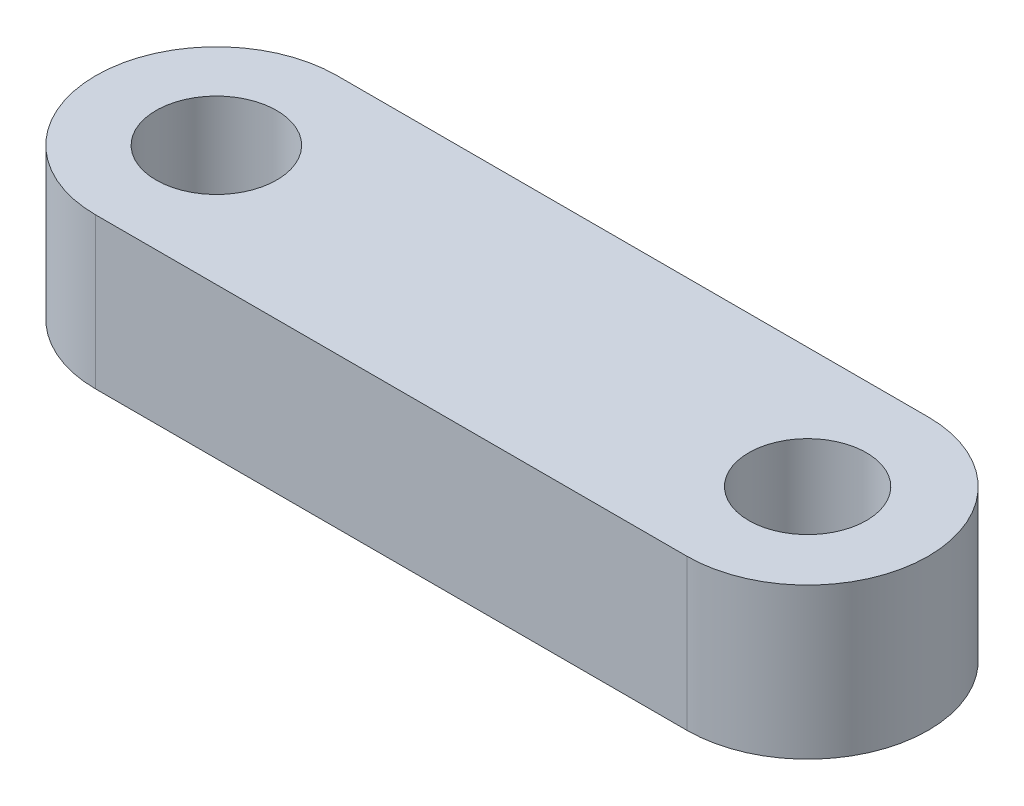
ISO-10303-21;
HEADER;
FILE_DESCRIPTION(('STEP AP214'),'2;1');
FILE_NAME('part.step','',(''),(''),'','','');
FILE_SCHEMA(('AUTOMOTIVE_DESIGN { 1 0 10303 214 1 1 1 1 }'));
ENDSEC;
DATA;
#1=APPLICATION_CONTEXT('core data for automotive mechanical design processes');
#2=APPLICATION_PROTOCOL_DEFINITION('international standard','automotive_design',2000,#1);
#3=PRODUCT_CONTEXT('',#1,'mechanical');
#4=PRODUCT('Part','Part','',(#3));
#5=PRODUCT_RELATED_PRODUCT_CATEGORY('part','',(#4));
#6=PRODUCT_DEFINITION_FORMATION('','',#4);
#7=PRODUCT_DEFINITION_CONTEXT('part definition',#1,'design');
#8=PRODUCT_DEFINITION('design','',#6,#7);
#9=PRODUCT_DEFINITION_SHAPE('','',#8);
#10=(LENGTH_UNIT() NAMED_UNIT(*) SI_UNIT(.MILLI.,.METRE.));
#11=(NAMED_UNIT(*) PLANE_ANGLE_UNIT() SI_UNIT($,.RADIAN.));
#12=(NAMED_UNIT(*) SI_UNIT($,.STERADIAN.) SOLID_ANGLE_UNIT());
#13=UNCERTAINTY_MEASURE_WITH_UNIT(LENGTH_MEASURE(1.E-05),#10,'distance_accuracy_value','');
#14=(GEOMETRIC_REPRESENTATION_CONTEXT(3) GLOBAL_UNCERTAINTY_ASSIGNED_CONTEXT((#13)) GLOBAL_UNIT_ASSIGNED_CONTEXT((#10,
#11,#12)) REPRESENTATION_CONTEXT('',''));
#15=CARTESIAN_POINT('',(0.,0.,0.));
#16=DIRECTION('',(0.,0.,1.));
#17=DIRECTION('',(1.,0.,0.));
#18=AXIS2_PLACEMENT_3D('',#15,#16,#17);
#19=CARTESIAN_POINT('',(0.,5.,0.));
#20=DIRECTION('',(0.,1.,0.));
#21=DIRECTION('',(0.,0.,1.));
#22=AXIS2_PLACEMENT_3D('',#19,#20,#21);
#23=PLANE('',#22);
#24=CARTESIAN_POINT('',(0.,5.,0.));
#25=DIRECTION('',(0.,1.,0.));
#26=DIRECTION('',(0.,0.,1.));
#27=AXIS2_PLACEMENT_3D('',#24,#25,#26);
#28=CIRCLE('',#27,2.);
#29=CARTESIAN_POINT('',(0.,5.,2.));
#30=VERTEX_POINT('',#29);
#31=EDGE_CURVE('E101',#30,#30,#28,.T.);
#32=ORIENTED_EDGE('',*,*,#31,.F.);
#33=EDGE_LOOP('',(#32));
#34=FACE_BOUND('',#33,.T.);
#35=CARTESIAN_POINT('',(0.,5.,0.));
#36=DIRECTION('',(0.,1.,0.));
#37=DIRECTION('',(0.,0.,1.));
#38=AXIS2_PLACEMENT_3D('',#35,#36,#37);
#39=CIRCLE('',#38,4.);
#40=CARTESIAN_POINT('',(0.,5.,-4.));
#41=VERTEX_POINT('',#40);
#42=CARTESIAN_POINT('',(0.,5.,4.));
#43=VERTEX_POINT('',#42);
#44=EDGE_CURVE('E86',#41,#43,#39,.T.);
#45=ORIENTED_EDGE('',*,*,#44,.T.);
#46=DIRECTION('',(1.,0.,0.));
#47=VECTOR('',#46,1.);
#48=CARTESIAN_POINT('',(0.,5.,4.));
#49=LINE('',#48,#47);
#50=CARTESIAN_POINT('',(19.604,5.,4.));
#51=VERTEX_POINT('',#50);
#52=EDGE_CURVE('E81',#43,#51,#49,.T.);
#53=ORIENTED_EDGE('',*,*,#52,.T.);
#54=CARTESIAN_POINT('',(19.604,5.,0.));
#55=DIRECTION('',(0.,1.,0.));
#56=DIRECTION('',(0.,0.,1.));
#57=AXIS2_PLACEMENT_3D('',#54,#55,#56);
#58=CIRCLE('',#57,4.);
#59=CARTESIAN_POINT('',(19.604,5.,-4.));
#60=VERTEX_POINT('',#59);
#61=EDGE_CURVE('E84',#51,#60,#58,.T.);
#62=ORIENTED_EDGE('',*,*,#61,.T.);
#63=DIRECTION('',(-1.,0.,0.));
#64=VECTOR('',#63,1.);
#65=CARTESIAN_POINT('',(0.,5.,-4.));
#66=LINE('',#65,#64);
#67=EDGE_CURVE('E51',#60,#41,#66,.T.);
#68=ORIENTED_EDGE('',*,*,#67,.T.);
#69=EDGE_LOOP('',(#45,#53,#62,#68));
#70=FACE_BOUND('',#69,.T.);
#71=CARTESIAN_POINT('',(19.604,5.,0.));
#72=DIRECTION('',(0.,1.,0.));
#73=DIRECTION('',(0.,0.,1.));
#74=AXIS2_PLACEMENT_3D('',#71,#72,#73);
#75=CIRCLE('',#74,1.95);
#76=CARTESIAN_POINT('',(19.604,5.,1.95));
#77=VERTEX_POINT('',#76);
#78=EDGE_CURVE('E116',#77,#77,#75,.T.);
#79=ORIENTED_EDGE('',*,*,#78,.F.);
#80=EDGE_LOOP('',(#79));
#81=FACE_BOUND('',#80,.T.);
#82=ADVANCED_FACE('F34',(#34,#70,#81),#23,.T.);
#83=CARTESIAN_POINT('',(0.,0.,0.));
#84=DIRECTION('',(0.,1.,0.));
#85=DIRECTION('',(0.,0.,1.));
#86=AXIS2_PLACEMENT_3D('',#83,#84,#85);
#87=PLANE('',#86);
#88=CARTESIAN_POINT('',(0.,0.,0.));
#89=DIRECTION('',(0.,1.,0.));
#90=DIRECTION('',(0.,0.,1.));
#91=AXIS2_PLACEMENT_3D('',#88,#89,#90);
#92=CIRCLE('',#91,4.);
#93=CARTESIAN_POINT('',(0.,0.,-4.));
#94=VERTEX_POINT('',#93);
#95=CARTESIAN_POINT('',(0.,0.,4.));
#96=VERTEX_POINT('',#95);
#97=EDGE_CURVE('E98',#94,#96,#92,.T.);
#98=ORIENTED_EDGE('',*,*,#97,.F.);
#99=DIRECTION('',(-1.,0.,0.));
#100=VECTOR('',#99,1.);
#101=CARTESIAN_POINT('',(0.,0.,-4.));
#102=LINE('',#101,#100);
#103=CARTESIAN_POINT('',(19.604,0.,-4.));
#104=VERTEX_POINT('',#103);
#105=EDGE_CURVE('E74',#104,#94,#102,.T.);
#106=ORIENTED_EDGE('',*,*,#105,.F.);
#107=CARTESIAN_POINT('',(19.604,0.,0.));
#108=DIRECTION('',(0.,1.,0.));
#109=DIRECTION('',(0.,0.,1.));
#110=AXIS2_PLACEMENT_3D('',#107,#108,#109);
#111=CIRCLE('',#110,4.);
#112=CARTESIAN_POINT('',(19.604,0.,4.));
#113=VERTEX_POINT('',#112);
#114=EDGE_CURVE('E68',#113,#104,#111,.T.);
#115=ORIENTED_EDGE('',*,*,#114,.F.);
#116=DIRECTION('',(1.,0.,0.));
#117=VECTOR('',#116,1.);
#118=CARTESIAN_POINT('',(0.,0.,4.));
#119=LINE('',#118,#117);
#120=EDGE_CURVE('E90',#96,#113,#119,.T.);
#121=ORIENTED_EDGE('',*,*,#120,.F.);
#122=EDGE_LOOP('',(#98,#106,#115,#121));
#123=FACE_BOUND('',#122,.T.);
#124=CARTESIAN_POINT('',(0.,0.,0.));
#125=DIRECTION('',(0.,1.,0.));
#126=DIRECTION('',(0.,0.,1.));
#127=AXIS2_PLACEMENT_3D('',#124,#125,#126);
#128=CIRCLE('',#127,2.);
#129=CARTESIAN_POINT('',(0.,0.,2.));
#130=VERTEX_POINT('',#129);
#131=EDGE_CURVE('E113',#130,#130,#128,.T.);
#132=ORIENTED_EDGE('',*,*,#131,.T.);
#133=EDGE_LOOP('',(#132));
#134=FACE_BOUND('',#133,.T.);
#135=CARTESIAN_POINT('',(19.604,0.,0.));
#136=DIRECTION('',(0.,1.,0.));
#137=DIRECTION('',(0.,0.,1.));
#138=AXIS2_PLACEMENT_3D('',#135,#136,#137);
#139=CIRCLE('',#138,1.95);
#140=CARTESIAN_POINT('',(19.604,0.,1.95));
#141=VERTEX_POINT('',#140);
#142=EDGE_CURVE('E119',#141,#141,#139,.T.);
#143=ORIENTED_EDGE('',*,*,#142,.T.);
#144=EDGE_LOOP('',(#143));
#145=FACE_BOUND('',#144,.T.);
#146=ADVANCED_FACE('F109',(#123,#134,#145),#87,.F.);
#147=CARTESIAN_POINT('',(0.,5.,0.));
#148=DIRECTION('',(0.,-1.,0.));
#149=DIRECTION('',(0.,0.,-1.));
#150=AXIS2_PLACEMENT_3D('',#147,#148,#149);
#151=CYLINDRICAL_SURFACE('',#150,4.);
#152=ORIENTED_EDGE('',*,*,#97,.T.);
#153=DIRECTION('',(0.,-1.,0.));
#154=VECTOR('',#153,1.);
#155=CARTESIAN_POINT('',(0.,5.,4.));
#156=LINE('',#155,#154);
#157=EDGE_CURVE('E11',#43,#96,#156,.T.);
#158=ORIENTED_EDGE('',*,*,#157,.F.);
#159=ORIENTED_EDGE('',*,*,#44,.F.);
#160=DIRECTION('',(0.,-1.,0.));
#161=VECTOR('',#160,1.);
#162=CARTESIAN_POINT('',(0.,5.,-4.));
#163=LINE('',#162,#161);
#164=EDGE_CURVE('E94',#41,#94,#163,.T.);
#165=ORIENTED_EDGE('',*,*,#164,.T.);
#166=EDGE_LOOP('',(#152,#158,#159,#165));
#167=FACE_BOUND('',#166,.T.);
#168=ADVANCED_FACE('F36',(#167),#151,.T.);
#169=CARTESIAN_POINT('',(0.,5.,4.));
#170=DIRECTION('',(0.,0.,-1.));
#171=DIRECTION('',(-1.,0.,0.));
#172=AXIS2_PLACEMENT_3D('',#169,#170,#171);
#173=PLANE('',#172);
#174=ORIENTED_EDGE('',*,*,#120,.T.);
#175=DIRECTION('',(0.,-1.,0.));
#176=VECTOR('',#175,1.);
#177=CARTESIAN_POINT('',(19.604,5.,4.));
#178=LINE('',#177,#176);
#179=EDGE_CURVE('E43',#51,#113,#178,.T.);
#180=ORIENTED_EDGE('',*,*,#179,.F.);
#181=ORIENTED_EDGE('',*,*,#52,.F.);
#182=ORIENTED_EDGE('',*,*,#157,.T.);
#183=EDGE_LOOP('',(#174,#180,#181,#182));
#184=FACE_BOUND('',#183,.T.);
#185=ADVANCED_FACE('F89',(#184),#173,.F.);
#186=CARTESIAN_POINT('',(19.604,5.,0.));
#187=DIRECTION('',(0.,-1.,0.));
#188=DIRECTION('',(0.,0.,-1.));
#189=AXIS2_PLACEMENT_3D('',#186,#187,#188);
#190=CYLINDRICAL_SURFACE('',#189,4.);
#191=ORIENTED_EDGE('',*,*,#114,.T.);
#192=DIRECTION('',(0.,-1.,0.));
#193=VECTOR('',#192,1.);
#194=CARTESIAN_POINT('',(19.604,5.,-4.));
#195=LINE('',#194,#193);
#196=EDGE_CURVE('E91',#60,#104,#195,.T.);
#197=ORIENTED_EDGE('',*,*,#196,.F.);
#198=ORIENTED_EDGE('',*,*,#61,.F.);
#199=ORIENTED_EDGE('',*,*,#179,.T.);
#200=EDGE_LOOP('',(#191,#197,#198,#199));
#201=FACE_BOUND('',#200,.T.);
#202=ADVANCED_FACE('F92',(#201),#190,.T.);
#203=CARTESIAN_POINT('',(0.,5.,-4.));
#204=DIRECTION('',(0.,0.,1.));
#205=DIRECTION('',(1.,0.,0.));
#206=AXIS2_PLACEMENT_3D('',#203,#204,#205);
#207=PLANE('',#206);
#208=ORIENTED_EDGE('',*,*,#105,.T.);
#209=ORIENTED_EDGE('',*,*,#164,.F.);
#210=ORIENTED_EDGE('',*,*,#67,.F.);
#211=ORIENTED_EDGE('',*,*,#196,.T.);
#212=EDGE_LOOP('',(#208,#209,#210,#211));
#213=FACE_BOUND('',#212,.T.);
#214=ADVANCED_FACE('F106',(#213),#207,.F.);
#215=CARTESIAN_POINT('',(0.,5.,0.));
#216=DIRECTION('',(0.,-1.,0.));
#217=DIRECTION('',(0.,0.,-1.));
#218=AXIS2_PLACEMENT_3D('',#215,#216,#217);
#219=CYLINDRICAL_SURFACE('',#218,2.);
#220=ORIENTED_EDGE('',*,*,#31,.T.);
#221=EDGE_LOOP('',(#220));
#222=FACE_BOUND('',#221,.T.);
#223=ORIENTED_EDGE('',*,*,#131,.F.);
#224=EDGE_LOOP('',(#223));
#225=FACE_BOUND('',#224,.T.);
#226=ADVANCED_FACE('F136',(#222,#225),#219,.F.);
#227=CARTESIAN_POINT('',(19.604,5.,0.));
#228=DIRECTION('',(0.,-1.,0.));
#229=DIRECTION('',(0.,0.,-1.));
#230=AXIS2_PLACEMENT_3D('',#227,#228,#229);
#231=CYLINDRICAL_SURFACE('',#230,1.95);
#232=ORIENTED_EDGE('',*,*,#78,.T.);
#233=EDGE_LOOP('',(#232));
#234=FACE_BOUND('',#233,.T.);
#235=ORIENTED_EDGE('',*,*,#142,.F.);
#236=EDGE_LOOP('',(#235));
#237=FACE_BOUND('',#236,.T.);
#238=ADVANCED_FACE('F125',(#234,#237),#231,.F.);
#239=CLOSED_SHELL('',(#82,#146,#168,#185,#202,#214,#226,#238));
#240=MANIFOLD_SOLID_BREP('B2',#239);
#241=ADVANCED_BREP_SHAPE_REPRESENTATION('',(#18,#240),#14);
#242=SHAPE_DEFINITION_REPRESENTATION(#9,#241);
ENDSEC;
END-ISO-10303-21;
